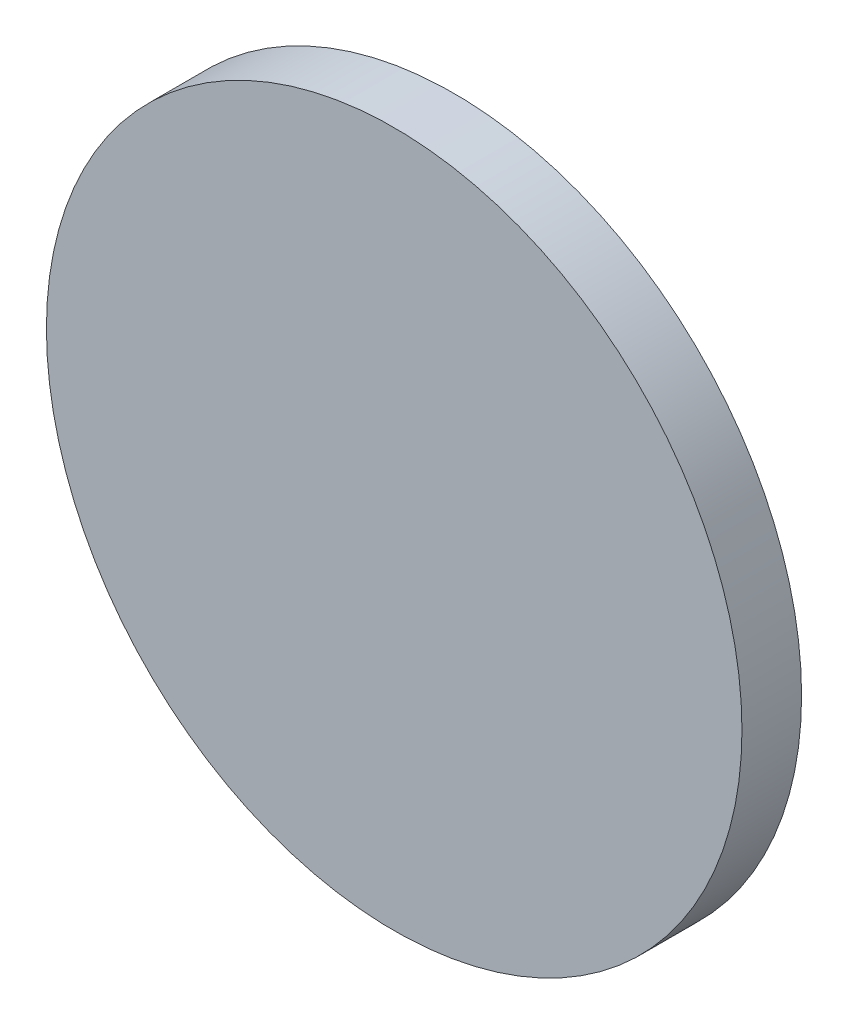
ISO-10303-21;
HEADER;
FILE_DESCRIPTION(('STEP AP214'),'2;1');
FILE_NAME('part.step','',(''),(''),'','','');
FILE_SCHEMA(('AUTOMOTIVE_DESIGN { 1 0 10303 214 1 1 1 1 }'));
ENDSEC;
DATA;
#1=APPLICATION_CONTEXT('core data for automotive mechanical design processes');
#2=APPLICATION_PROTOCOL_DEFINITION('international standard','automotive_design',2000,#1);
#3=PRODUCT_CONTEXT('',#1,'mechanical');
#4=PRODUCT('Part','Part','',(#3));
#5=PRODUCT_RELATED_PRODUCT_CATEGORY('part','',(#4));
#6=PRODUCT_DEFINITION_FORMATION('','',#4);
#7=PRODUCT_DEFINITION_CONTEXT('part definition',#1,'design');
#8=PRODUCT_DEFINITION('design','',#6,#7);
#9=PRODUCT_DEFINITION_SHAPE('','',#8);
#10=(LENGTH_UNIT() NAMED_UNIT(*) SI_UNIT(.MILLI.,.METRE.));
#11=(NAMED_UNIT(*) PLANE_ANGLE_UNIT() SI_UNIT($,.RADIAN.));
#12=(NAMED_UNIT(*) SI_UNIT($,.STERADIAN.) SOLID_ANGLE_UNIT());
#13=UNCERTAINTY_MEASURE_WITH_UNIT(LENGTH_MEASURE(1.E-05),#10,'distance_accuracy_value','');
#14=(GEOMETRIC_REPRESENTATION_CONTEXT(3) GLOBAL_UNCERTAINTY_ASSIGNED_CONTEXT((#13)) GLOBAL_UNIT_ASSIGNED_CONTEXT((#10,
#11,#12)) REPRESENTATION_CONTEXT('',''));
#15=CARTESIAN_POINT('',(0.,0.,0.));
#16=DIRECTION('',(0.,0.,1.));
#17=DIRECTION('',(1.,0.,0.));
#18=AXIS2_PLACEMENT_3D('',#15,#16,#17);
#19=CARTESIAN_POINT('',(1.6129,3.058160006176,0.79916));
#20=DIRECTION('',(0.,0.,1.));
#21=DIRECTION('',(1.,0.,0.));
#22=AXIS2_PLACEMENT_3D('',#19,#20,#21);
#23=PLANE('',#22);
#24=CARTESIAN_POINT('',(1.6129,3.058160006176,0.79916));
#25=DIRECTION('',(0.,0.,1.));
#26=DIRECTION('',(1.,0.,0.));
#27=AXIS2_PLACEMENT_3D('',#24,#25,#26);
#28=CIRCLE('',#27,0.200024667);
#29=CARTESIAN_POINT('',(1.812924667,3.058160006176,0.79916));
#30=VERTEX_POINT('',#29);
#31=EDGE_CURVE('E18',#30,#30,#28,.F.);
#32=ORIENTED_EDGE('',*,*,#31,.F.);
#33=EDGE_LOOP('',(#32));
#34=FACE_BOUND('',#33,.T.);
#35=ADVANCED_FACE('F15',(#34),#23,.T.);
#36=CARTESIAN_POINT('',(1.6129,3.058160006176,0.76487));
#37=DIRECTION('',(0.,0.,1.));
#38=DIRECTION('',(1.,0.,0.));
#39=AXIS2_PLACEMENT_3D('',#36,#37,#38);
#40=CYLINDRICAL_SURFACE('',#39,0.200024667);
#41=ORIENTED_EDGE('',*,*,#31,.T.);
#42=EDGE_LOOP('',(#41));
#43=FACE_BOUND('',#42,.T.);
#44=CARTESIAN_POINT('',(1.6129,3.058160006176,0.76487));
#45=DIRECTION('',(0.,0.,1.));
#46=DIRECTION('',(1.,0.,0.));
#47=AXIS2_PLACEMENT_3D('',#44,#45,#46);
#48=CIRCLE('',#47,0.200024667);
#49=CARTESIAN_POINT('',(1.812924667,3.058160006176,0.76487));
#50=VERTEX_POINT('',#49);
#51=EDGE_CURVE('E10',#50,#50,#48,.F.);
#52=ORIENTED_EDGE('',*,*,#51,.F.);
#53=EDGE_LOOP('',(#52));
#54=FACE_BOUND('',#53,.T.);
#55=ADVANCED_FACE('F27',(#43,#54),#40,.T.);
#56=CARTESIAN_POINT('',(1.6129,3.058160006176,0.76487));
#57=DIRECTION('',(0.,0.,-1.));
#58=DIRECTION('',(-1.,0.,0.));
#59=AXIS2_PLACEMENT_3D('',#56,#57,#58);
#60=PLANE('',#59);
#61=ORIENTED_EDGE('',*,*,#51,.T.);
#62=EDGE_LOOP('',(#61));
#63=FACE_BOUND('',#62,.T.);
#64=ADVANCED_FACE('F35',(#63),#60,.T.);
#65=CLOSED_SHELL('',(#35,#55,#64));
#66=MANIFOLD_SOLID_BREP('B1',#65);
#67=ADVANCED_BREP_SHAPE_REPRESENTATION('',(#18,#66),#14);
#68=SHAPE_DEFINITION_REPRESENTATION(#9,#67);
ENDSEC;
END-ISO-10303-21;
